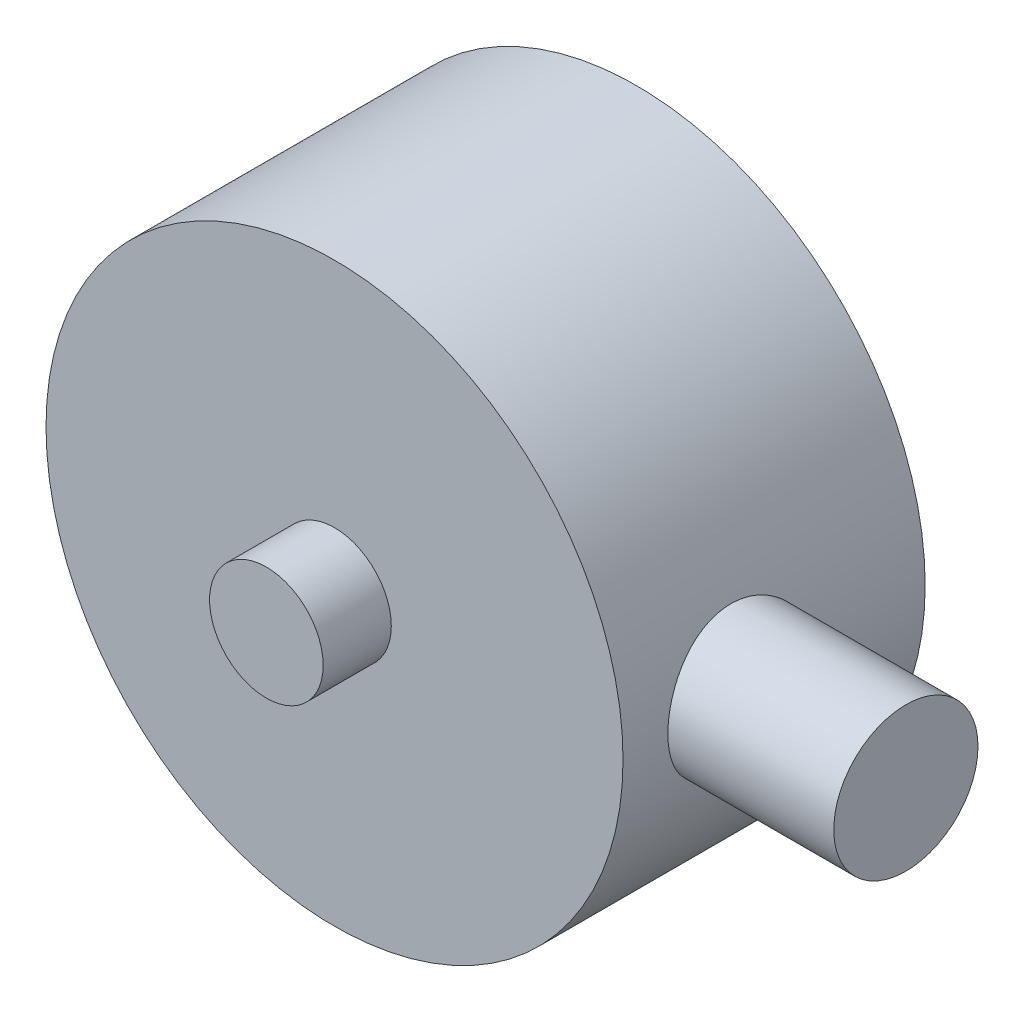
ISO-10303-21;
HEADER;
FILE_DESCRIPTION(('STEP AP214'),'2;1');
FILE_NAME('part.step','',(''),(''),'','','');
FILE_SCHEMA(('AUTOMOTIVE_DESIGN { 1 0 10303 214 1 1 1 1 }'));
ENDSEC;
DATA;
#1=APPLICATION_CONTEXT('core data for automotive mechanical design processes');
#2=APPLICATION_PROTOCOL_DEFINITION('international standard','automotive_design',2000,#1);
#3=PRODUCT_CONTEXT('',#1,'mechanical');
#4=PRODUCT('Part','Part','',(#3));
#5=PRODUCT_RELATED_PRODUCT_CATEGORY('part','',(#4));
#6=PRODUCT_DEFINITION_FORMATION('','',#4);
#7=PRODUCT_DEFINITION_CONTEXT('part definition',#1,'design');
#8=PRODUCT_DEFINITION('design','',#6,#7);
#9=PRODUCT_DEFINITION_SHAPE('','',#8);
#10=(LENGTH_UNIT() NAMED_UNIT(*) SI_UNIT(.MILLI.,.METRE.));
#11=(NAMED_UNIT(*) PLANE_ANGLE_UNIT() SI_UNIT($,.RADIAN.));
#12=(NAMED_UNIT(*) SI_UNIT($,.STERADIAN.) SOLID_ANGLE_UNIT());
#13=UNCERTAINTY_MEASURE_WITH_UNIT(LENGTH_MEASURE(1.E-05),#10,'distance_accuracy_value','');
#14=(GEOMETRIC_REPRESENTATION_CONTEXT(3) GLOBAL_UNCERTAINTY_ASSIGNED_CONTEXT((#13)) GLOBAL_UNIT_ASSIGNED_CONTEXT((#10,
#11,#12)) REPRESENTATION_CONTEXT('',''));
#15=CARTESIAN_POINT('',(0.,0.,0.));
#16=DIRECTION('',(0.,0.,1.));
#17=DIRECTION('',(1.,0.,0.));
#18=AXIS2_PLACEMENT_3D('',#15,#16,#17);
#19=CARTESIAN_POINT('',(0.,0.,13.3));
#20=DIRECTION('',(0.,0.,-1.));
#21=DIRECTION('',(-1.,0.,0.));
#22=AXIS2_PLACEMENT_3D('',#19,#20,#21);
#23=CYLINDRICAL_SURFACE('',#22,12.7);
#24=CARTESIAN_POINT('',(0.,0.,13.3));
#25=DIRECTION('',(0.,0.,1.));
#26=DIRECTION('',(1.,0.,0.));
#27=AXIS2_PLACEMENT_3D('',#24,#25,#26);
#28=CIRCLE('',#27,12.7);
#29=CARTESIAN_POINT('',(12.7,0.,13.3));
#30=VERTEX_POINT('',#29);
#31=EDGE_CURVE('E49',#30,#30,#28,.T.);
#32=ORIENTED_EDGE('',*,*,#31,.F.);
#33=EDGE_LOOP('',(#32));
#34=FACE_BOUND('',#33,.T.);
#35=CARTESIAN_POINT('',(0.,0.,0.));
#36=DIRECTION('',(0.,0.,1.));
#37=DIRECTION('',(1.,0.,0.));
#38=AXIS2_PLACEMENT_3D('',#35,#36,#37);
#39=CIRCLE('',#38,12.7);
#40=CARTESIAN_POINT('',(12.7,0.,0.));
#41=VERTEX_POINT('',#40);
#42=EDGE_CURVE('E54',#41,#41,#39,.T.);
#43=ORIENTED_EDGE('',*,*,#42,.T.);
#44=EDGE_LOOP('',(#43));
#45=FACE_BOUND('',#44,.T.);
#46=CARTESIAN_POINT('',(12.7,0.,11.325));
#47=CARTESIAN_POINT('',(12.6999970338729,-0.17542105435093,11.3249950771876));
#48=CARTESIAN_POINT('',(12.6963292371237,-0.350897100741782,11.3104128841955));
#49=CARTESIAN_POINT('',(12.6820530760661,-0.69682005198096,11.2525567630668));
#50=CARTESIAN_POINT('',(12.6714407780562,-0.867264049209731,11.2092665731449));
#51=CARTESIAN_POINT('',(12.6444507573613,-1.19807751278645,11.0954702468386));
#52=CARTESIAN_POINT('',(12.6280799601569,-1.35845880926017,11.0249967927193));
#53=CARTESIAN_POINT('',(12.591316443928,-1.6651226791977,10.8589493910718));
#54=CARTESIAN_POINT('',(12.5709235892463,-1.81140477687155,10.7633745968815));
#55=CARTESIAN_POINT('',(12.5278602543575,-2.08873074612027,10.5477583285653));
#56=CARTESIAN_POINT('',(12.5051546346353,-2.2194428772959,10.4272971663367));
#57=CARTESIAN_POINT('',(12.4602582924963,-2.45903522924703,10.1662261662759));
#58=CARTESIAN_POINT('',(12.4380676284689,-2.56791298487579,10.025614056429));
#59=CARTESIAN_POINT('',(12.3963594189446,-2.76230618225783,9.72565677007337));
#60=CARTESIAN_POINT('',(12.3768864828385,-2.84745052370821,9.56606432812153));
#61=CARTESIAN_POINT('',(12.343330973648,-2.98957345643241,9.23426586198626));
#62=CARTESIAN_POINT('',(12.3292475388652,-3.04655655068163,9.06206185944723));
#63=CARTESIAN_POINT('',(12.3084267567388,-3.12960773790342,8.71357626213982));
#64=CARTESIAN_POINT('',(12.3015478927701,-3.15627230130285,8.53744547005292));
#65=CARTESIAN_POINT('',(12.2954915053947,-3.17978742389056,8.18308652895139));
#66=CARTESIAN_POINT('',(12.2963127290578,-3.176642833515,8.00485872586831));
#67=CARTESIAN_POINT('',(12.3054365167726,-3.14110481048738,7.65593654027234));
#68=CARTESIAN_POINT('',(12.3135572669877,-3.10942215340351,7.48516426789838));
#69=CARTESIAN_POINT('',(12.3360753547043,-3.01884119561133,7.15143910890493));
#70=CARTESIAN_POINT('',(12.3504731393489,-2.95994095604688,6.98848678025545));
#71=CARTESIAN_POINT('',(12.3840899110031,-2.81599106163371,6.67312119893299));
#72=CARTESIAN_POINT('',(12.4033560981111,-2.73068344564301,6.52083093637874));
#73=CARTESIAN_POINT('',(12.4445122129068,-2.53652078423164,6.23247206434806));
#74=CARTESIAN_POINT('',(12.4664025994163,-2.42766161831204,6.09640629992432));
#75=CARTESIAN_POINT('',(12.5111061380944,-2.18580424890858,5.84028568011351));
#76=CARTESIAN_POINT('',(12.533927803951,-2.05220624645107,5.72079799603681));
#77=CARTESIAN_POINT('',(12.5773596047503,-1.76659522538283,5.50581503678474));
#78=CARTESIAN_POINT('',(12.5979696721291,-1.61458164448181,5.41032049447545));
#79=CARTESIAN_POINT('',(12.6347586626604,-1.29564529770895,5.24582625915838));
#80=CARTESIAN_POINT('',(12.6509221227036,-1.12867311562492,5.17691869646146));
#81=CARTESIAN_POINT('',(12.676884242985,-0.785020883902435,5.06830836958141));
#82=CARTESIAN_POINT('',(12.6866841206814,-0.608342698201858,5.02860001891494));
#83=CARTESIAN_POINT('',(12.6986347345774,-0.255142937325557,4.98038148623379));
#84=CARTESIAN_POINT('',(12.7009747992585,-0.0787330573083785,4.97109892814061));
#85=CARTESIAN_POINT('',(12.6982813685726,0.273119584996525,4.98187705435078));
#86=CARTESIAN_POINT('',(12.6932485369526,0.448562432914395,5.00193509725817));
#87=CARTESIAN_POINT('',(12.6764961338622,0.790816868910238,5.07018842276175));
#88=CARTESIAN_POINT('',(12.6648767569325,0.957717835150521,5.11796234102626));
#89=CARTESIAN_POINT('',(12.6362609570897,1.28112793569116,5.23980999452691));
#90=CARTESIAN_POINT('',(12.6192639911647,1.43763601861911,5.31388638579632));
#91=CARTESIAN_POINT('',(12.5813250177716,1.73889063454314,5.4877331394514));
#92=CARTESIAN_POINT('',(12.5603183592593,1.88337918521904,5.58793610457274));
#93=CARTESIAN_POINT('',(12.5167921111412,2.15376466554501,5.81063864028733));
#94=CARTESIAN_POINT('',(12.4942722608556,2.27965837982672,5.93314205885733));
#95=CARTESIAN_POINT('',(12.4495762556412,2.51246336908675,6.20055415045254));
#96=CARTESIAN_POINT('',(12.4274221051899,2.6188328531313,6.34593897134919));
#97=CARTESIAN_POINT('',(12.3865825924258,2.80566443991221,6.65295074295838));
#98=CARTESIAN_POINT('',(12.3678970761538,2.88612769264178,6.814576972287));
#99=CARTESIAN_POINT('',(12.3363163381503,3.0182638402854,7.14861711242697));
#100=CARTESIAN_POINT('',(12.3233869021911,3.07010730622843,7.32096014659597));
#101=CARTESIAN_POINT('',(12.3047494152553,3.14398164687971,7.67228873345877));
#102=CARTESIAN_POINT('',(12.299039785006,3.16601904149253,7.85127282465607));
#103=CARTESIAN_POINT('',(12.2956087422145,3.17931501621074,8.2052895005204));
#104=CARTESIAN_POINT('',(12.2976625750886,3.17143955029538,8.38028790438749));
#105=CARTESIAN_POINT('',(12.3090074061494,3.1271152390873,8.72637656437626));
#106=CARTESIAN_POINT('',(12.3182982588945,3.09066696801937,8.8974668989669));
#107=CARTESIAN_POINT('',(12.3429450180984,2.9907046261569,9.22994123834368));
#108=CARTESIAN_POINT('',(12.3582644892528,2.92735297324093,9.39137696275538));
#109=CARTESIAN_POINT('',(12.3932474960913,2.7755107337966,9.70144339341371));
#110=CARTESIAN_POINT('',(12.4129116342002,2.68701666057215,9.85007231991314));
#111=CARTESIAN_POINT('',(12.4550092586011,2.48468673461549,10.1344906313868));
#112=CARTESIAN_POINT('',(12.4775016056118,2.37025002816433,10.2698439387472));
#113=CARTESIAN_POINT('',(12.5223699100401,2.12045416901821,10.5197079114838));
#114=CARTESIAN_POINT('',(12.5447458385544,1.98509005500274,10.6342136204058));
#115=CARTESIAN_POINT('',(12.5873437112106,1.6943230585205,10.8411539364617));
#116=CARTESIAN_POINT('',(12.6075193062447,1.53860166056969,10.9331512656048));
#117=CARTESIAN_POINT('',(12.6429542453062,1.21341315929717,11.0895154632241));
#118=CARTESIAN_POINT('',(12.6582171100619,1.04395600927443,11.1539021300394));
#119=CARTESIAN_POINT('',(12.6798505941374,0.729001702698682,11.2436603741978));
#120=CARTESIAN_POINT('',(12.6873547169486,0.585004695088745,11.2740967977964));
#121=CARTESIAN_POINT('',(12.6974304774096,0.294017851418466,11.3147679139998));
#122=CARTESIAN_POINT('',(12.7000024860439,0.147028241296871,11.3250041260296));
#123=CARTESIAN_POINT('',(12.7,0.,11.325));
#124=B_SPLINE_CURVE_WITH_KNOTS('',3,(#46,#47,#48,#49,#50,#51,#52,#53,#54,#55,#56,#57,#58,#59,
#60,#61,#62,#63,#64,#65,#66,#67,#68,#69,#70,#71,#72,#73,#74,#75,#76,#77,#78,#79,#80,#81,#82,#83,
#84,#85,#86,#87,#88,#89,#90,#91,#92,#93,#94,#95,#96,#97,#98,#99,#100,#101,#102,#103,#104,#105,
#106,#107,#108,#109,#110,#111,#112,#113,#114,#115,#116,#117,#118,#119,#120,#121,#122,#123),
.UNSPECIFIED.,.T.,.F.,(4,2,2,2,2,2,2,2,2,2,2,2,2,2,2,2,2,2,2,2,2,2,2,2,2,2,2,2,2,2,2,2,2,2,2,2,
2,2,4),(0.,0.525724358065499,1.05174676993359,1.57713870983892,2.10254837335841,
2.63767221675277,3.17285644277798,3.71599137305291,4.25903942808496,4.79120824630598,
5.32329047345571,5.84247618671884,6.36169889010143,6.8861628400674,7.41071862276906,
7.95023177058119,8.48976139571985,9.0311441807632,9.57242335981323,10.09985087283,
10.6272309069567,11.1467958106174,11.6664131950588,12.1952509368702,12.7241800170734,
13.266092111565,13.8079801469349,14.34660272276,14.885107458967,15.4081433519175,
15.9311687337377,16.4510804786766,16.9710643590661,17.5046127008447,18.0382877269755,
18.5816279265763,19.1245778677202,19.5652441424438,20.005877269746),.UNSPECIFIED.);
#125=CARTESIAN_POINT('',(12.7,0.,11.325));
#126=VERTEX_POINT('',#125);
#127=EDGE_CURVE('E10',#126,#126,#124,.T.);
#128=ORIENTED_EDGE('',*,*,#127,.F.);
#129=EDGE_LOOP('',(#128));
#130=FACE_BOUND('',#129,.T.);
#131=ADVANCED_FACE('F34',(#34,#45,#130),#23,.T.);
#132=CARTESIAN_POINT('',(0.,0.,13.3));
#133=DIRECTION('',(0.,0.,1.));
#134=DIRECTION('',(1.,0.,0.));
#135=AXIS2_PLACEMENT_3D('',#132,#133,#134);
#136=PLANE('',#135);
#137=CARTESIAN_POINT('',(0.,0.,13.3));
#138=DIRECTION('',(0.,0.,1.));
#139=DIRECTION('',(1.,0.,0.));
#140=AXIS2_PLACEMENT_3D('',#137,#138,#139);
#141=CIRCLE('',#140,2.5);
#142=CARTESIAN_POINT('',(2.5,0.,13.3));
#143=VERTEX_POINT('',#142);
#144=EDGE_CURVE('E45',#143,#143,#141,.T.);
#145=ORIENTED_EDGE('',*,*,#144,.F.);
#146=EDGE_LOOP('',(#145));
#147=FACE_BOUND('',#146,.T.);
#148=ORIENTED_EDGE('',*,*,#31,.T.);
#149=EDGE_LOOP('',(#148));
#150=FACE_BOUND('',#149,.T.);
#151=ADVANCED_FACE('F91',(#147,#150),#136,.T.);
#152=CARTESIAN_POINT('',(0.,0.,0.));
#153=DIRECTION('',(0.,0.,1.));
#154=DIRECTION('',(1.,0.,0.));
#155=AXIS2_PLACEMENT_3D('',#152,#153,#154);
#156=PLANE('',#155);
#157=CARTESIAN_POINT('',(0.,0.,0.));
#158=DIRECTION('',(0.,0.,1.));
#159=DIRECTION('',(1.,0.,0.));
#160=AXIS2_PLACEMENT_3D('',#157,#158,#159);
#161=CIRCLE('',#160,2.5);
#162=CARTESIAN_POINT('',(2.5,0.,0.));
#163=VERTEX_POINT('',#162);
#164=EDGE_CURVE('E61',#163,#163,#161,.T.);
#165=ORIENTED_EDGE('',*,*,#164,.T.);
#166=EDGE_LOOP('',(#165));
#167=FACE_BOUND('',#166,.T.);
#168=ORIENTED_EDGE('',*,*,#42,.F.);
#169=EDGE_LOOP('',(#168));
#170=FACE_BOUND('',#169,.T.);
#171=ADVANCED_FACE('F96',(#167,#170),#156,.F.);
#172=CARTESIAN_POINT('',(0.,0.,-6.35));
#173=DIRECTION('',(0.,0.,1.));
#174=DIRECTION('',(1.,0.,0.));
#175=AXIS2_PLACEMENT_3D('',#172,#173,#174);
#176=PLANE('',#175);
#177=CARTESIAN_POINT('',(0.,0.,-6.35));
#178=DIRECTION('',(0.,0.,1.));
#179=DIRECTION('',(1.,0.,0.));
#180=AXIS2_PLACEMENT_3D('',#177,#178,#179);
#181=CIRCLE('',#180,2.5);
#182=CARTESIAN_POINT('',(2.5,0.,-6.35));
#183=VERTEX_POINT('',#182);
#184=EDGE_CURVE('E57',#183,#183,#181,.T.);
#185=ORIENTED_EDGE('',*,*,#184,.F.);
#186=EDGE_LOOP('',(#185));
#187=FACE_BOUND('',#186,.T.);
#188=ADVANCED_FACE('F105',(#187),#176,.F.);
#189=CARTESIAN_POINT('',(0.,0.,-6.35));
#190=DIRECTION('',(0.,0.,1.));
#191=DIRECTION('',(1.,0.,0.));
#192=AXIS2_PLACEMENT_3D('',#189,#190,#191);
#193=CYLINDRICAL_SURFACE('',#192,2.5);
#194=ORIENTED_EDGE('',*,*,#184,.T.);
#195=EDGE_LOOP('',(#194));
#196=FACE_BOUND('',#195,.T.);
#197=ORIENTED_EDGE('',*,*,#164,.F.);
#198=EDGE_LOOP('',(#197));
#199=FACE_BOUND('',#198,.T.);
#200=ADVANCED_FACE('F109',(#196,#199),#193,.T.);
#201=ORIENTED_EDGE('',*,*,#144,.T.);
#202=EDGE_LOOP('',(#201));
#203=FACE_BOUND('',#202,.T.);
#204=CARTESIAN_POINT('',(0.,0.,16.3));
#205=DIRECTION('',(0.,0.,1.));
#206=DIRECTION('',(1.,0.,0.));
#207=AXIS2_PLACEMENT_3D('',#204,#205,#206);
#208=CIRCLE('',#207,2.5);
#209=CARTESIAN_POINT('',(2.5,0.,16.3));
#210=VERTEX_POINT('',#209);
#211=EDGE_CURVE('E66',#210,#210,#208,.T.);
#212=ORIENTED_EDGE('',*,*,#211,.F.);
#213=EDGE_LOOP('',(#212));
#214=FACE_BOUND('',#213,.T.);
#215=ADVANCED_FACE('F87',(#203,#214),#193,.T.);
#216=CARTESIAN_POINT('',(0.,0.,16.3));
#217=DIRECTION('',(0.,0.,1.));
#218=DIRECTION('',(1.,0.,0.));
#219=AXIS2_PLACEMENT_3D('',#216,#217,#218);
#220=PLANE('',#219);
#221=ORIENTED_EDGE('',*,*,#211,.T.);
#222=EDGE_LOOP('',(#221));
#223=FACE_BOUND('',#222,.T.);
#224=ADVANCED_FACE('F81',(#223),#220,.T.);
#225=CARTESIAN_POINT('',(20.,0.,8.15));
#226=DIRECTION('',(-1.,0.,0.));
#227=DIRECTION('',(0.,0.,1.));
#228=AXIS2_PLACEMENT_3D('',#225,#226,#227);
#229=CYLINDRICAL_SURFACE('',#228,3.175);
#230=CARTESIAN_POINT('',(20.,0.,8.15));
#231=DIRECTION('',(1.,0.,0.));
#232=DIRECTION('',(0.,0.,-1.));
#233=AXIS2_PLACEMENT_3D('',#230,#231,#232);
#234=CIRCLE('',#233,3.175);
#235=CARTESIAN_POINT('',(20.,0.,4.975));
#236=VERTEX_POINT('',#235);
#237=EDGE_CURVE('E70',#236,#236,#234,.T.);
#238=ORIENTED_EDGE('',*,*,#237,.F.);
#239=EDGE_LOOP('',(#238));
#240=FACE_BOUND('',#239,.T.);
#241=ORIENTED_EDGE('',*,*,#127,.T.);
#242=EDGE_LOOP('',(#241));
#243=FACE_BOUND('',#242,.T.);
#244=ADVANCED_FACE('F79',(#240,#243),#229,.T.);
#245=CARTESIAN_POINT('',(20.,0.,8.15));
#246=DIRECTION('',(1.,0.,0.));
#247=DIRECTION('',(0.,0.,-1.));
#248=AXIS2_PLACEMENT_3D('',#245,#246,#247);
#249=PLANE('',#248);
#250=ORIENTED_EDGE('',*,*,#237,.T.);
#251=EDGE_LOOP('',(#250));
#252=FACE_BOUND('',#251,.T.);
#253=ADVANCED_FACE('F77',(#252),#249,.T.);
#254=CLOSED_SHELL('',(#131,#151,#171,#188,#200,#215,#224,#244,#253));
#255=MANIFOLD_SOLID_BREP('B2',#254);
#256=ADVANCED_BREP_SHAPE_REPRESENTATION('',(#18,#255),#14);
#257=SHAPE_DEFINITION_REPRESENTATION(#9,#256);
ENDSEC;
END-ISO-10303-21;
